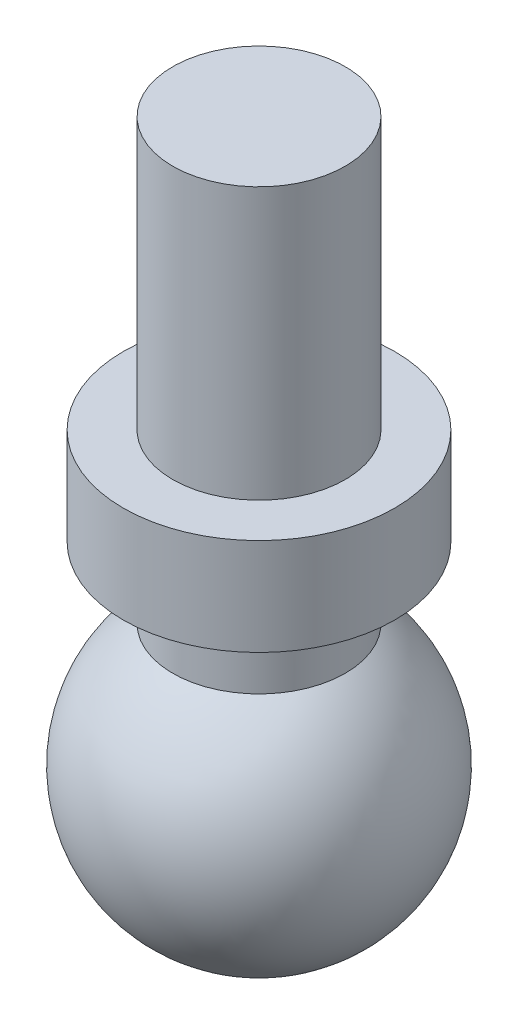
ISO-10303-21;
HEADER;
FILE_DESCRIPTION(('STEP AP214'),'2;1');
FILE_NAME('part.step','',(''),(''),'','','');
FILE_SCHEMA(('AUTOMOTIVE_DESIGN { 1 0 10303 214 1 1 1 1 }'));
ENDSEC;
DATA;
#1=APPLICATION_CONTEXT('core data for automotive mechanical design processes');
#2=APPLICATION_PROTOCOL_DEFINITION('international standard','automotive_design',2000,#1);
#3=PRODUCT_CONTEXT('',#1,'mechanical');
#4=PRODUCT('Part','Part','',(#3));
#5=PRODUCT_RELATED_PRODUCT_CATEGORY('part','',(#4));
#6=PRODUCT_DEFINITION_FORMATION('','',#4);
#7=PRODUCT_DEFINITION_CONTEXT('part definition',#1,'design');
#8=PRODUCT_DEFINITION('design','',#6,#7);
#9=PRODUCT_DEFINITION_SHAPE('','',#8);
#10=(LENGTH_UNIT() NAMED_UNIT(*) SI_UNIT(.MILLI.,.METRE.));
#11=(NAMED_UNIT(*) PLANE_ANGLE_UNIT() SI_UNIT($,.RADIAN.));
#12=(NAMED_UNIT(*) SI_UNIT($,.STERADIAN.) SOLID_ANGLE_UNIT());
#13=UNCERTAINTY_MEASURE_WITH_UNIT(LENGTH_MEASURE(1.E-05),#10,'distance_accuracy_value','');
#14=(GEOMETRIC_REPRESENTATION_CONTEXT(3) GLOBAL_UNCERTAINTY_ASSIGNED_CONTEXT((#13)) GLOBAL_UNIT_ASSIGNED_CONTEXT((#10,
#11,#12)) REPRESENTATION_CONTEXT('',''));
#15=CARTESIAN_POINT('',(0.,0.,0.));
#16=DIRECTION('',(0.,0.,1.));
#17=DIRECTION('',(1.,0.,0.));
#18=AXIS2_PLACEMENT_3D('',#15,#16,#17);
#19=CARTESIAN_POINT('',(0.,7.366,0.));
#20=DIRECTION('',(0.,-1.,0.));
#21=DIRECTION('',(0.,0.,-1.));
#22=AXIS2_PLACEMENT_3D('',#19,#20,#21);
#23=CYLINDRICAL_SURFACE('',#22,1.1303);
#24=CARTESIAN_POINT('',(0.,3.81,0.));
#25=DIRECTION('',(0.,1.,0.));
#26=DIRECTION('',(0.,0.,1.));
#27=AXIS2_PLACEMENT_3D('',#24,#25,#26);
#28=CIRCLE('',#27,1.1303);
#29=CARTESIAN_POINT('',(0.,3.81,1.1303));
#30=VERTEX_POINT('',#29);
#31=EDGE_CURVE('E41',#30,#30,#28,.T.);
#32=ORIENTED_EDGE('',*,*,#31,.T.);
#33=EDGE_LOOP('',(#32));
#34=FACE_BOUND('',#33,.T.);
#35=CARTESIAN_POINT('',(0.,7.366,0.));
#36=DIRECTION('',(0.,1.,0.));
#37=DIRECTION('',(0.,0.,1.));
#38=AXIS2_PLACEMENT_3D('',#35,#36,#37);
#39=CIRCLE('',#38,1.1303);
#40=CARTESIAN_POINT('',(0.,7.366,1.1303));
#41=VERTEX_POINT('',#40);
#42=EDGE_CURVE('E52',#41,#41,#39,.T.);
#43=ORIENTED_EDGE('',*,*,#42,.F.);
#44=EDGE_LOOP('',(#43));
#45=FACE_BOUND('',#44,.T.);
#46=ADVANCED_FACE('F37',(#34,#45),#23,.T.);
#47=CARTESIAN_POINT('',(0.,7.366,0.));
#48=DIRECTION('',(0.,1.,0.));
#49=DIRECTION('',(0.,0.,1.));
#50=AXIS2_PLACEMENT_3D('',#47,#48,#49);
#51=PLANE('',#50);
#52=ORIENTED_EDGE('',*,*,#42,.T.);
#53=EDGE_LOOP('',(#52));
#54=FACE_BOUND('',#53,.T.);
#55=ADVANCED_FACE('F75',(#54),#51,.T.);
#56=CARTESIAN_POINT('',(0.,3.81,0.));
#57=DIRECTION('',(0.,1.,0.));
#58=DIRECTION('',(0.,0.,1.));
#59=AXIS2_PLACEMENT_3D('',#56,#57,#58);
#60=PLANE('',#59);
#61=CARTESIAN_POINT('',(0.,3.81,0.));
#62=DIRECTION('',(0.,1.,0.));
#63=DIRECTION('',(0.,0.,1.));
#64=AXIS2_PLACEMENT_3D('',#61,#62,#63);
#65=CIRCLE('',#64,1.778);
#66=CARTESIAN_POINT('',(0.,3.81,1.778));
#67=VERTEX_POINT('',#66);
#68=EDGE_CURVE('E61',#67,#67,#65,.T.);
#69=ORIENTED_EDGE('',*,*,#68,.T.);
#70=EDGE_LOOP('',(#69));
#71=FACE_BOUND('',#70,.T.);
#72=ORIENTED_EDGE('',*,*,#31,.F.);
#73=EDGE_LOOP('',(#72));
#74=FACE_BOUND('',#73,.T.);
#75=ADVANCED_FACE('F72',(#71,#74),#60,.T.);
#76=CARTESIAN_POINT('',(0.,2.54,0.));
#77=DIRECTION('',(0.,1.,0.));
#78=DIRECTION('',(0.,0.,1.));
#79=AXIS2_PLACEMENT_3D('',#76,#77,#78);
#80=PLANE('',#79);
#81=CARTESIAN_POINT('',(0.,2.54,0.));
#82=DIRECTION('',(0.,1.,0.));
#83=DIRECTION('',(0.,0.,1.));
#84=AXIS2_PLACEMENT_3D('',#81,#82,#83);
#85=CIRCLE('',#84,1.778);
#86=CARTESIAN_POINT('',(0.,2.54,1.778));
#87=VERTEX_POINT('',#86);
#88=EDGE_CURVE('E57',#87,#87,#85,.T.);
#89=ORIENTED_EDGE('',*,*,#88,.F.);
#90=EDGE_LOOP('',(#89));
#91=FACE_BOUND('',#90,.T.);
#92=CARTESIAN_POINT('',(0.,2.54,0.));
#93=DIRECTION('',(0.,1.,0.));
#94=DIRECTION('',(0.,0.,1.));
#95=AXIS2_PLACEMENT_3D('',#92,#93,#94);
#96=CIRCLE('',#95,1.1303);
#97=CARTESIAN_POINT('',(0.,2.54,1.1303));
#98=VERTEX_POINT('',#97);
#99=EDGE_CURVE('E10',#98,#98,#96,.T.);
#100=ORIENTED_EDGE('',*,*,#99,.T.);
#101=EDGE_LOOP('',(#100));
#102=FACE_BOUND('',#101,.T.);
#103=ADVANCED_FACE('F74',(#91,#102),#80,.F.);
#104=CARTESIAN_POINT('',(0.,3.81,0.));
#105=DIRECTION('',(0.,-1.,0.));
#106=DIRECTION('',(0.,0.,-1.));
#107=AXIS2_PLACEMENT_3D('',#104,#105,#106);
#108=CYLINDRICAL_SURFACE('',#107,1.778);
#109=ORIENTED_EDGE('',*,*,#68,.F.);
#110=EDGE_LOOP('',(#109));
#111=FACE_BOUND('',#110,.T.);
#112=ORIENTED_EDGE('',*,*,#88,.T.);
#113=EDGE_LOOP('',(#112));
#114=FACE_BOUND('',#113,.T.);
#115=ADVANCED_FACE('F81',(#111,#114),#108,.T.);
#116=CARTESIAN_POINT('',(0.,0.,0.));
#117=DIRECTION('',(0.,1.,0.));
#118=DIRECTION('',(1.,0.,0.));
#119=AXIS2_PLACEMENT_3D('',#116,#117,#118);
#120=SPHERICAL_SURFACE('',#119,1.9685);
#121=CARTESIAN_POINT('',(0.,1.61164951524827,0.));
#122=DIRECTION('',(0.,-1.,0.));
#123=DIRECTION('',(0.,0.,-1.));
#124=AXIS2_PLACEMENT_3D('',#121,#122,#123);
#125=CIRCLE('',#124,1.1303);
#126=CARTESIAN_POINT('',(0.,1.61164951524827,-1.1303));
#127=VERTEX_POINT('',#126);
#128=EDGE_CURVE('E46',#127,#127,#125,.F.);
#129=ORIENTED_EDGE('',*,*,#128,.F.);
#130=EDGE_LOOP('',(#129));
#131=FACE_BOUND('',#130,.T.);
#132=ADVANCED_FACE('F39',(#131),#120,.T.);
#133=ORIENTED_EDGE('',*,*,#128,.T.);
#134=EDGE_LOOP('',(#133));
#135=FACE_BOUND('',#134,.T.);
#136=ORIENTED_EDGE('',*,*,#99,.F.);
#137=EDGE_LOOP('',(#136));
#138=FACE_BOUND('',#137,.T.);
#139=ADVANCED_FACE('F87',(#135,#138),#23,.T.);
#140=CLOSED_SHELL('',(#46,#55,#75,#103,#115,#132,#139));
#141=MANIFOLD_SOLID_BREP('B2',#140);
#142=ADVANCED_BREP_SHAPE_REPRESENTATION('',(#18,#141),#14);
#143=SHAPE_DEFINITION_REPRESENTATION(#9,#142);
ENDSEC;
END-ISO-10303-21;
